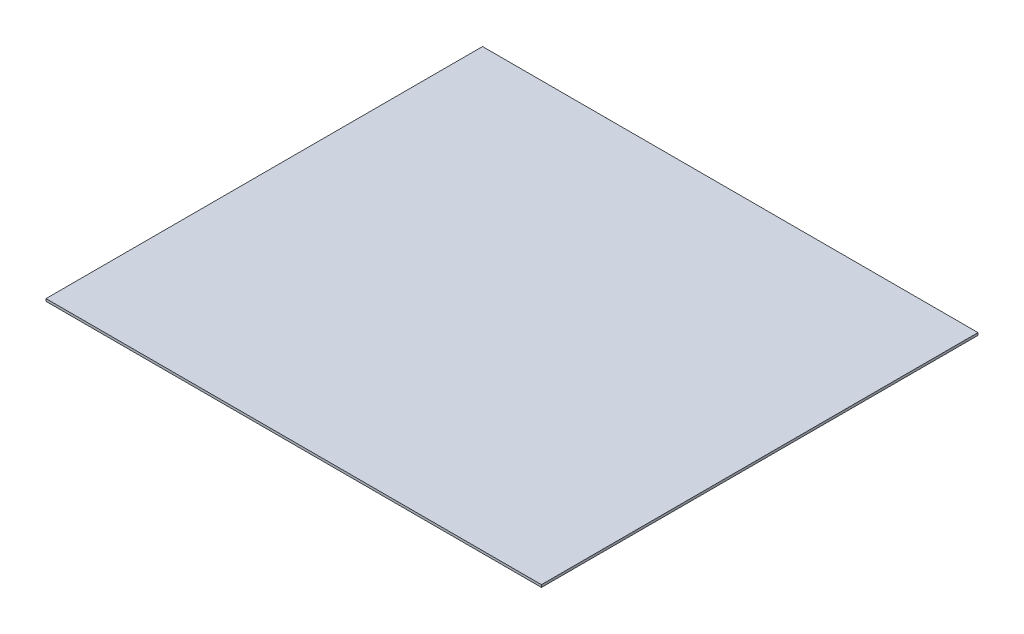
ISO-10303-21;
HEADER;
FILE_DESCRIPTION(('STEP AP214'),'2;1');
FILE_NAME('part.step','',(''),(''),'','','');
FILE_SCHEMA(('AUTOMOTIVE_DESIGN { 1 0 10303 214 1 1 1 1 }'));
ENDSEC;
DATA;
#1=APPLICATION_CONTEXT('core data for automotive mechanical design processes');
#2=APPLICATION_PROTOCOL_DEFINITION('international standard','automotive_design',2000,#1);
#3=PRODUCT_CONTEXT('',#1,'mechanical');
#4=PRODUCT('Part','Part','',(#3));
#5=PRODUCT_RELATED_PRODUCT_CATEGORY('part','',(#4));
#6=PRODUCT_DEFINITION_FORMATION('','',#4);
#7=PRODUCT_DEFINITION_CONTEXT('part definition',#1,'design');
#8=PRODUCT_DEFINITION('design','',#6,#7);
#9=PRODUCT_DEFINITION_SHAPE('','',#8);
#10=(LENGTH_UNIT() NAMED_UNIT(*) SI_UNIT(.MILLI.,.METRE.));
#11=(NAMED_UNIT(*) PLANE_ANGLE_UNIT() SI_UNIT($,.RADIAN.));
#12=(NAMED_UNIT(*) SI_UNIT($,.STERADIAN.) SOLID_ANGLE_UNIT());
#13=UNCERTAINTY_MEASURE_WITH_UNIT(LENGTH_MEASURE(1.E-05),#10,'distance_accuracy_value','');
#14=(GEOMETRIC_REPRESENTATION_CONTEXT(3) GLOBAL_UNCERTAINTY_ASSIGNED_CONTEXT((#13)) GLOBAL_UNIT_ASSIGNED_CONTEXT((#10,
#11,#12)) REPRESENTATION_CONTEXT('',''));
#15=CARTESIAN_POINT('',(0.,0.,0.));
#16=DIRECTION('',(0.,0.,1.));
#17=DIRECTION('',(1.,0.,0.));
#18=AXIS2_PLACEMENT_3D('',#15,#16,#17);
#19=CARTESIAN_POINT('',(1282.7,12.7,1130.173));
#20=DIRECTION('',(-1.,0.,0.));
#21=DIRECTION('',(0.,0.,1.));
#22=AXIS2_PLACEMENT_3D('',#19,#20,#21);
#23=PLANE('',#22);
#24=DIRECTION('',(0.,0.,-1.));
#25=VECTOR('',#24,1.);
#26=CARTESIAN_POINT('',(1282.7,0.,1130.173));
#27=LINE('',#26,#25);
#28=CARTESIAN_POINT('',(1282.7,0.,1130.173));
#29=VERTEX_POINT('',#28);
#30=CARTESIAN_POINT('',(1282.7,0.,-1130.173));
#31=VERTEX_POINT('',#30);
#32=EDGE_CURVE('E107',#29,#31,#27,.T.);
#33=ORIENTED_EDGE('',*,*,#32,.T.);
#34=DIRECTION('',(0.,-1.,0.));
#35=VECTOR('',#34,1.);
#36=CARTESIAN_POINT('',(1282.7,12.7,-1130.173));
#37=LINE('',#36,#35);
#38=CARTESIAN_POINT('',(1282.7,12.7,-1130.173));
#39=VERTEX_POINT('',#38);
#40=EDGE_CURVE('E11',#39,#31,#37,.T.);
#41=ORIENTED_EDGE('',*,*,#40,.F.);
#42=DIRECTION('',(0.,0.,-1.));
#43=VECTOR('',#42,1.);
#44=CARTESIAN_POINT('',(1282.7,12.7,1130.173));
#45=LINE('',#44,#43);
#46=CARTESIAN_POINT('',(1282.7,12.7,1130.173));
#47=VERTEX_POINT('',#46);
#48=EDGE_CURVE('E95',#47,#39,#45,.T.);
#49=ORIENTED_EDGE('',*,*,#48,.F.);
#50=DIRECTION('',(0.,-1.,0.));
#51=VECTOR('',#50,1.);
#52=CARTESIAN_POINT('',(1282.7,12.7,1130.173));
#53=LINE('',#52,#51);
#54=EDGE_CURVE('E103',#47,#29,#53,.T.);
#55=ORIENTED_EDGE('',*,*,#54,.T.);
#56=EDGE_LOOP('',(#33,#41,#49,#55));
#57=FACE_BOUND('',#56,.T.);
#58=ADVANCED_FACE('F44',(#57),#23,.F.);
#59=CARTESIAN_POINT('',(-1282.7,12.7,-1130.173));
#60=DIRECTION('',(0.,0.,1.));
#61=DIRECTION('',(1.,0.,0.));
#62=AXIS2_PLACEMENT_3D('',#59,#60,#61);
#63=PLANE('',#62);
#64=DIRECTION('',(-1.,0.,0.));
#65=VECTOR('',#64,1.);
#66=CARTESIAN_POINT('',(-1282.7,0.,-1130.173));
#67=LINE('',#66,#65);
#68=CARTESIAN_POINT('',(-1282.7,0.,-1130.173));
#69=VERTEX_POINT('',#68);
#70=EDGE_CURVE('E99',#31,#69,#67,.T.);
#71=ORIENTED_EDGE('',*,*,#70,.T.);
#72=DIRECTION('',(0.,-1.,0.));
#73=VECTOR('',#72,1.);
#74=CARTESIAN_POINT('',(-1282.7,12.7,-1130.173));
#75=LINE('',#74,#73);
#76=CARTESIAN_POINT('',(-1282.7,12.7,-1130.173));
#77=VERTEX_POINT('',#76);
#78=EDGE_CURVE('E52',#77,#69,#75,.T.);
#79=ORIENTED_EDGE('',*,*,#78,.F.);
#80=DIRECTION('',(-1.,0.,0.));
#81=VECTOR('',#80,1.);
#82=CARTESIAN_POINT('',(-1282.7,12.7,-1130.173));
#83=LINE('',#82,#81);
#84=EDGE_CURVE('E90',#39,#77,#83,.T.);
#85=ORIENTED_EDGE('',*,*,#84,.F.);
#86=ORIENTED_EDGE('',*,*,#40,.T.);
#87=EDGE_LOOP('',(#71,#79,#85,#86));
#88=FACE_BOUND('',#87,.T.);
#89=ADVANCED_FACE('F98',(#88),#63,.F.);
#90=CARTESIAN_POINT('',(-1282.7,12.7,1130.173));
#91=DIRECTION('',(1.,0.,0.));
#92=DIRECTION('',(0.,0.,-1.));
#93=AXIS2_PLACEMENT_3D('',#90,#91,#92);
#94=PLANE('',#93);
#95=DIRECTION('',(0.,0.,1.));
#96=VECTOR('',#95,1.);
#97=CARTESIAN_POINT('',(-1282.7,0.,1130.173));
#98=LINE('',#97,#96);
#99=CARTESIAN_POINT('',(-1282.7,0.,1130.173));
#100=VERTEX_POINT('',#99);
#101=EDGE_CURVE('E77',#69,#100,#98,.T.);
#102=ORIENTED_EDGE('',*,*,#101,.T.);
#103=DIRECTION('',(0.,-1.,0.));
#104=VECTOR('',#103,1.);
#105=CARTESIAN_POINT('',(-1282.7,12.7,1130.173));
#106=LINE('',#105,#104);
#107=CARTESIAN_POINT('',(-1282.7,12.7,1130.173));
#108=VERTEX_POINT('',#107);
#109=EDGE_CURVE('E100',#108,#100,#106,.T.);
#110=ORIENTED_EDGE('',*,*,#109,.F.);
#111=DIRECTION('',(0.,0.,1.));
#112=VECTOR('',#111,1.);
#113=CARTESIAN_POINT('',(-1282.7,12.7,1130.173));
#114=LINE('',#113,#112);
#115=EDGE_CURVE('E93',#77,#108,#114,.T.);
#116=ORIENTED_EDGE('',*,*,#115,.F.);
#117=ORIENTED_EDGE('',*,*,#78,.T.);
#118=EDGE_LOOP('',(#102,#110,#116,#117));
#119=FACE_BOUND('',#118,.T.);
#120=ADVANCED_FACE('F101',(#119),#94,.F.);
#121=CARTESIAN_POINT('',(-1282.7,12.7,1130.173));
#122=DIRECTION('',(0.,0.,-1.));
#123=DIRECTION('',(-1.,0.,0.));
#124=AXIS2_PLACEMENT_3D('',#121,#122,#123);
#125=PLANE('',#124);
#126=DIRECTION('',(1.,0.,0.));
#127=VECTOR('',#126,1.);
#128=CARTESIAN_POINT('',(-1282.7,0.,1130.173));
#129=LINE('',#128,#127);
#130=EDGE_CURVE('E83',#100,#29,#129,.T.);
#131=ORIENTED_EDGE('',*,*,#130,.T.);
#132=ORIENTED_EDGE('',*,*,#54,.F.);
#133=DIRECTION('',(1.,0.,0.));
#134=VECTOR('',#133,1.);
#135=CARTESIAN_POINT('',(-1282.7,12.7,1130.173));
#136=LINE('',#135,#134);
#137=EDGE_CURVE('E60',#108,#47,#136,.T.);
#138=ORIENTED_EDGE('',*,*,#137,.F.);
#139=ORIENTED_EDGE('',*,*,#109,.T.);
#140=EDGE_LOOP('',(#131,#132,#138,#139));
#141=FACE_BOUND('',#140,.T.);
#142=ADVANCED_FACE('F114',(#141),#125,.F.);
#143=CARTESIAN_POINT('',(0.,12.7,0.));
#144=DIRECTION('',(0.,-1.,0.));
#145=DIRECTION('',(0.,0.,-1.));
#146=AXIS2_PLACEMENT_3D('',#143,#144,#145);
#147=PLANE('',#146);
#148=ORIENTED_EDGE('',*,*,#48,.T.);
#149=ORIENTED_EDGE('',*,*,#84,.T.);
#150=ORIENTED_EDGE('',*,*,#115,.T.);
#151=ORIENTED_EDGE('',*,*,#137,.T.);
#152=EDGE_LOOP('',(#148,#149,#150,#151));
#153=FACE_BOUND('',#152,.T.);
#154=ADVANCED_FACE('F91',(#153),#147,.F.);
#155=CARTESIAN_POINT('',(0.,0.,0.));
#156=DIRECTION('',(0.,-1.,0.));
#157=DIRECTION('',(0.,0.,-1.));
#158=AXIS2_PLACEMENT_3D('',#155,#156,#157);
#159=PLANE('',#158);
#160=ORIENTED_EDGE('',*,*,#32,.F.);
#161=ORIENTED_EDGE('',*,*,#130,.F.);
#162=ORIENTED_EDGE('',*,*,#101,.F.);
#163=ORIENTED_EDGE('',*,*,#70,.F.);
#164=EDGE_LOOP('',(#160,#161,#162,#163));
#165=FACE_BOUND('',#164,.T.);
#166=ADVANCED_FACE('F117',(#165),#159,.T.);
#167=CLOSED_SHELL('',(#58,#89,#120,#142,#154,#166));
#168=MANIFOLD_SOLID_BREP('B2',#167);
#169=ADVANCED_BREP_SHAPE_REPRESENTATION('',(#18,#168),#14);
#170=SHAPE_DEFINITION_REPRESENTATION(#9,#169);
ENDSEC;
END-ISO-10303-21;
